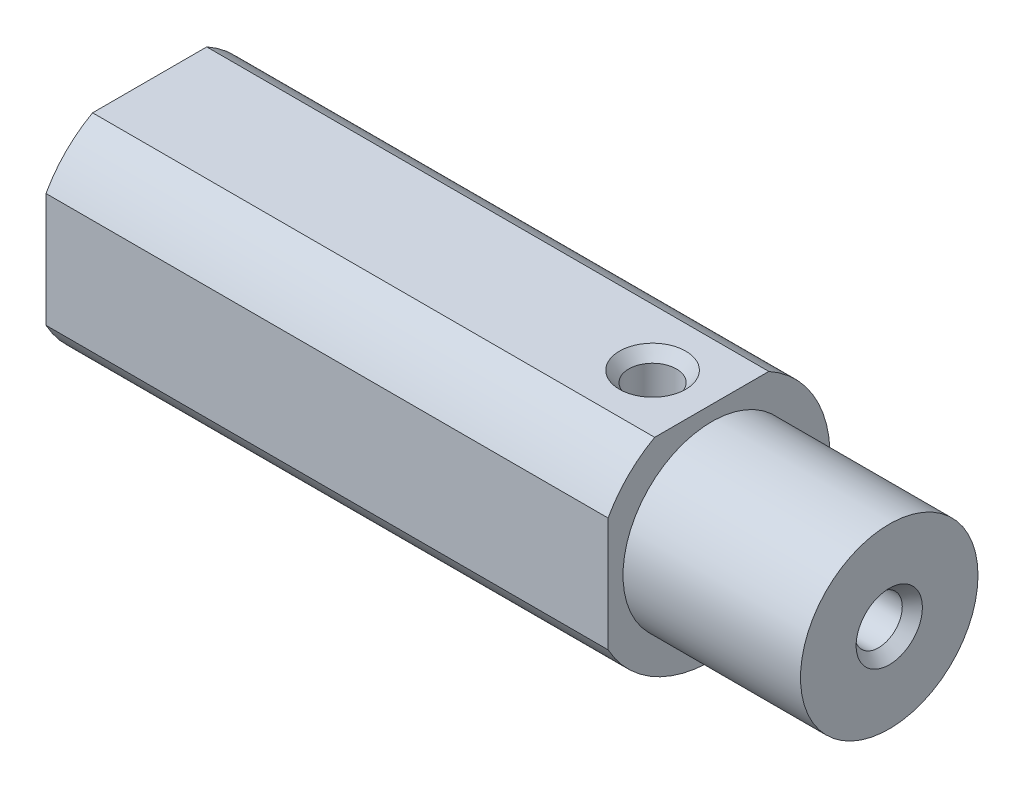
ISO-10303-21;
HEADER;
FILE_DESCRIPTION(('STEP AP214'),'2;1');
FILE_NAME('part.step','',(''),(''),'','','');
FILE_SCHEMA(('AUTOMOTIVE_DESIGN { 1 0 10303 214 1 1 1 1 }'));
ENDSEC;
DATA;
#1=APPLICATION_CONTEXT('core data for automotive mechanical design processes');
#2=APPLICATION_PROTOCOL_DEFINITION('international standard','automotive_design',2000,#1);
#3=PRODUCT_CONTEXT('',#1,'mechanical');
#4=PRODUCT('Part','Part','',(#3));
#5=PRODUCT_RELATED_PRODUCT_CATEGORY('part','',(#4));
#6=PRODUCT_DEFINITION_FORMATION('','',#4);
#7=PRODUCT_DEFINITION_CONTEXT('part definition',#1,'design');
#8=PRODUCT_DEFINITION('design','',#6,#7);
#9=PRODUCT_DEFINITION_SHAPE('','',#8);
#10=(LENGTH_UNIT() NAMED_UNIT(*) SI_UNIT(.MILLI.,.METRE.));
#11=(NAMED_UNIT(*) PLANE_ANGLE_UNIT() SI_UNIT($,.RADIAN.));
#12=(NAMED_UNIT(*) SI_UNIT($,.STERADIAN.) SOLID_ANGLE_UNIT());
#13=UNCERTAINTY_MEASURE_WITH_UNIT(LENGTH_MEASURE(1.E-05),#10,'distance_accuracy_value','');
#14=(GEOMETRIC_REPRESENTATION_CONTEXT(3) GLOBAL_UNCERTAINTY_ASSIGNED_CONTEXT((#13)) GLOBAL_UNIT_ASSIGNED_CONTEXT((#10,
#11,#12)) REPRESENTATION_CONTEXT('',''));
#15=CARTESIAN_POINT('',(0.,0.,0.));
#16=DIRECTION('',(0.,0.,1.));
#17=DIRECTION('',(1.,0.,0.));
#18=AXIS2_PLACEMENT_3D('',#15,#16,#17);
#19=CARTESIAN_POINT('',(-79.375,0.,0.));
#20=DIRECTION('',(1.,0.,0.));
#21=DIRECTION('',(0.,0.,-1.));
#22=AXIS2_PLACEMENT_3D('',#19,#20,#21);
#23=CYLINDRICAL_SURFACE('',#22,12.7);
#24=CARTESIAN_POINT('',(-19.05,0.,0.));
#25=DIRECTION('',(1.,0.,0.));
#26=DIRECTION('',(0.,0.,-1.));
#27=AXIS2_PLACEMENT_3D('',#24,#25,#26);
#28=CIRCLE('',#27,12.7);
#29=CARTESIAN_POINT('',(-19.05,6.12535100708523,11.1252));
#30=VERTEX_POINT('',#29);
#31=CARTESIAN_POINT('',(-19.05,11.1252,6.12535100708523));
#32=VERTEX_POINT('',#31);
#33=EDGE_CURVE('E141',#30,#32,#28,.F.);
#34=ORIENTED_EDGE('',*,*,#33,.T.);
#35=DIRECTION('',(1.,0.,0.));
#36=VECTOR('',#35,1.);
#37=CARTESIAN_POINT('',(-79.375,11.1252,6.12535100708523));
#38=LINE('',#37,#36);
#39=CARTESIAN_POINT('',(-79.375,11.1252,6.12535100708523));
#40=VERTEX_POINT('',#39);
#41=EDGE_CURVE('E62',#32,#40,#38,.F.);
#42=ORIENTED_EDGE('',*,*,#41,.T.);
#43=CARTESIAN_POINT('',(-79.375,0.,0.));
#44=DIRECTION('',(1.,0.,0.));
#45=DIRECTION('',(0.,0.,-1.));
#46=AXIS2_PLACEMENT_3D('',#43,#44,#45);
#47=CIRCLE('',#46,12.7);
#48=CARTESIAN_POINT('',(-79.375,6.12535100708523,11.1252));
#49=VERTEX_POINT('',#48);
#50=EDGE_CURVE('E140',#40,#49,#47,.T.);
#51=ORIENTED_EDGE('',*,*,#50,.T.);
#52=DIRECTION('',(1.,0.,0.));
#53=VECTOR('',#52,1.);
#54=CARTESIAN_POINT('',(-79.375,6.12535100708523,11.1252));
#55=LINE('',#54,#53);
#56=EDGE_CURVE('E124',#49,#30,#55,.T.);
#57=ORIENTED_EDGE('',*,*,#56,.T.);
#58=EDGE_LOOP('',(#34,#42,#51,#57));
#59=FACE_BOUND('',#58,.T.);
#60=ADVANCED_FACE('F48',(#59),#23,.T.);
#61=CARTESIAN_POINT('',(-79.375,-6.12535100708523,11.1252));
#62=VERTEX_POINT('',#61);
#63=CARTESIAN_POINT('',(-79.375,11.1252,-6.12535100708523));
#64=VERTEX_POINT('',#63);
#65=EDGE_CURVE('E137',#62,#64,#47,.T.);
#66=ORIENTED_EDGE('',*,*,#65,.T.);
#67=DIRECTION('',(1.,0.,0.));
#68=VECTOR('',#67,1.);
#69=CARTESIAN_POINT('',(-79.375,11.1252,-6.12535100708523));
#70=LINE('',#69,#68);
#71=CARTESIAN_POINT('',(-19.05,11.1252,-6.12535100708523));
#72=VERTEX_POINT('',#71);
#73=EDGE_CURVE('E119',#64,#72,#70,.T.);
#74=ORIENTED_EDGE('',*,*,#73,.T.);
#75=CARTESIAN_POINT('',(-19.05,-6.12535100708523,11.1252));
#76=VERTEX_POINT('',#75);
#77=EDGE_CURVE('E69',#72,#76,#28,.F.);
#78=ORIENTED_EDGE('',*,*,#77,.T.);
#79=DIRECTION('',(1.,0.,0.));
#80=VECTOR('',#79,1.);
#81=CARTESIAN_POINT('',(-79.375,-6.12535100708523,11.1252));
#82=LINE('',#81,#80);
#83=EDGE_CURVE('E127',#76,#62,#82,.F.);
#84=ORIENTED_EDGE('',*,*,#83,.T.);
#85=EDGE_LOOP('',(#66,#74,#78,#84));
#86=FACE_BOUND('',#85,.T.);
#87=ADVANCED_FACE('F157',(#86),#23,.T.);
#88=CARTESIAN_POINT('',(-79.375,0.,0.));
#89=DIRECTION('',(1.,0.,0.));
#90=DIRECTION('',(0.,0.,-1.));
#91=AXIS2_PLACEMENT_3D('',#88,#89,#90);
#92=PLANE('',#91);
#93=DIRECTION('',(0.,0.,1.));
#94=VECTOR('',#93,1.);
#95=CARTESIAN_POINT('',(-79.375,11.1252,0.));
#96=LINE('',#95,#94);
#97=EDGE_CURVE('E122',#64,#40,#96,.T.);
#98=ORIENTED_EDGE('',*,*,#97,.F.);
#99=ORIENTED_EDGE('',*,*,#65,.F.);
#100=DIRECTION('',(0.,-1.,0.));
#101=VECTOR('',#100,1.);
#102=CARTESIAN_POINT('',(-79.375,0.,11.1252));
#103=LINE('',#102,#101);
#104=EDGE_CURVE('E129',#49,#62,#103,.T.);
#105=ORIENTED_EDGE('',*,*,#104,.F.);
#106=ORIENTED_EDGE('',*,*,#50,.F.);
#107=EDGE_LOOP('',(#98,#99,#105,#106));
#108=FACE_BOUND('',#107,.T.);
#109=ADVANCED_FACE('F155',(#108),#92,.F.);
#110=CARTESIAN_POINT('',(-19.05,0.,0.));
#111=DIRECTION('',(1.,0.,0.));
#112=DIRECTION('',(0.,0.,-1.));
#113=AXIS2_PLACEMENT_3D('',#110,#111,#112);
#114=PLANE('',#113);
#115=CARTESIAN_POINT('',(-19.05,0.,0.));
#116=DIRECTION('',(1.,0.,0.));
#117=DIRECTION('',(0.,0.,-1.));
#118=AXIS2_PLACEMENT_3D('',#115,#116,#117);
#119=CIRCLE('',#118,9.525);
#120=CARTESIAN_POINT('',(-19.05,0.,-9.525));
#121=VERTEX_POINT('',#120);
#122=EDGE_CURVE('E132',#121,#121,#119,.T.);
#123=ORIENTED_EDGE('',*,*,#122,.F.);
#124=EDGE_LOOP('',(#123));
#125=FACE_BOUND('',#124,.T.);
#126=ORIENTED_EDGE('',*,*,#77,.F.);
#127=DIRECTION('',(0.,0.,1.));
#128=VECTOR('',#127,1.);
#129=CARTESIAN_POINT('',(-19.05,11.1252,0.));
#130=LINE('',#129,#128);
#131=EDGE_CURVE('E13',#72,#32,#130,.T.);
#132=ORIENTED_EDGE('',*,*,#131,.T.);
#133=ORIENTED_EDGE('',*,*,#33,.F.);
#134=DIRECTION('',(0.,-1.,0.));
#135=VECTOR('',#134,1.);
#136=CARTESIAN_POINT('',(-19.05,0.,11.1252));
#137=LINE('',#136,#135);
#138=EDGE_CURVE('E55',#30,#76,#137,.T.);
#139=ORIENTED_EDGE('',*,*,#138,.T.);
#140=EDGE_LOOP('',(#126,#132,#133,#139));
#141=FACE_BOUND('',#140,.T.);
#142=ADVANCED_FACE('F146',(#125,#141),#114,.T.);
#143=CARTESIAN_POINT('',(-19.05,0.,0.));
#144=DIRECTION('',(1.,0.,0.));
#145=DIRECTION('',(0.,0.,-1.));
#146=AXIS2_PLACEMENT_3D('',#143,#144,#145);
#147=CYLINDRICAL_SURFACE('',#146,9.525);
#148=ORIENTED_EDGE('',*,*,#122,.T.);
#149=EDGE_LOOP('',(#148));
#150=FACE_BOUND('',#149,.T.);
#151=CARTESIAN_POINT('',(0.,0.,0.));
#152=DIRECTION('',(1.,0.,0.));
#153=DIRECTION('',(0.,0.,-1.));
#154=AXIS2_PLACEMENT_3D('',#151,#152,#153);
#155=CIRCLE('',#154,9.525);
#156=CARTESIAN_POINT('',(0.,0.,-9.525));
#157=VERTEX_POINT('',#156);
#158=EDGE_CURVE('E131',#157,#157,#155,.T.);
#159=ORIENTED_EDGE('',*,*,#158,.F.);
#160=EDGE_LOOP('',(#159));
#161=FACE_BOUND('',#160,.T.);
#162=ADVANCED_FACE('F184',(#150,#161),#147,.T.);
#163=CARTESIAN_POINT('',(0.,0.,0.));
#164=DIRECTION('',(1.,0.,0.));
#165=DIRECTION('',(0.,0.,-1.));
#166=AXIS2_PLACEMENT_3D('',#163,#164,#165);
#167=PLANE('',#166);
#168=CARTESIAN_POINT('',(0.,0.,0.));
#169=DIRECTION('',(1.,0.,0.));
#170=DIRECTION('',(0.,0.,-1.));
#171=AXIS2_PLACEMENT_3D('',#168,#169,#170);
#172=CIRCLE('',#171,3.556);
#173=CARTESIAN_POINT('',(0.,0.,-3.556));
#174=VERTEX_POINT('',#173);
#175=EDGE_CURVE('E110',#174,#174,#172,.T.);
#176=ORIENTED_EDGE('',*,*,#175,.F.);
#177=EDGE_LOOP('',(#176));
#178=FACE_BOUND('',#177,.T.);
#179=ORIENTED_EDGE('',*,*,#158,.T.);
#180=EDGE_LOOP('',(#179));
#181=FACE_BOUND('',#180,.T.);
#182=ADVANCED_FACE('F170',(#178,#181),#167,.T.);
#183=CARTESIAN_POINT('',(-91.2436173816218,-25.5220707846333,11.1252));
#184=DIRECTION('',(0.,0.,1.));
#185=DIRECTION('',(1.,0.,0.));
#186=AXIS2_PLACEMENT_3D('',#183,#184,#185);
#187=PLANE('',#186);
#188=ORIENTED_EDGE('',*,*,#104,.T.);
#189=ORIENTED_EDGE('',*,*,#83,.F.);
#190=ORIENTED_EDGE('',*,*,#138,.F.);
#191=ORIENTED_EDGE('',*,*,#56,.F.);
#192=EDGE_LOOP('',(#188,#189,#190,#191));
#193=FACE_BOUND('',#192,.T.);
#194=ADVANCED_FACE('F149',(#193),#187,.T.);
#195=CARTESIAN_POINT('',(-96.4133134907001,11.1252,24.8096946684768));
#196=DIRECTION('',(0.,1.,0.));
#197=DIRECTION('',(0.,0.,1.));
#198=AXIS2_PLACEMENT_3D('',#195,#196,#197);
#199=PLANE('',#198);
#200=CARTESIAN_POINT('',(-25.4,11.1252,0.));
#201=DIRECTION('',(0.,1.,0.));
#202=DIRECTION('',(0.,0.,1.));
#203=AXIS2_PLACEMENT_3D('',#200,#201,#202);
#204=CIRCLE('',#203,3.556);
#205=CARTESIAN_POINT('',(-25.4,11.1252,3.556));
#206=VERTEX_POINT('',#205);
#207=EDGE_CURVE('E103',#206,#206,#204,.T.);
#208=ORIENTED_EDGE('',*,*,#207,.F.);
#209=EDGE_LOOP('',(#208));
#210=FACE_BOUND('',#209,.T.);
#211=ORIENTED_EDGE('',*,*,#97,.T.);
#212=ORIENTED_EDGE('',*,*,#41,.F.);
#213=ORIENTED_EDGE('',*,*,#131,.F.);
#214=ORIENTED_EDGE('',*,*,#73,.F.);
#215=EDGE_LOOP('',(#211,#212,#213,#214));
#216=FACE_BOUND('',#215,.T.);
#217=ADVANCED_FACE('F158',(#210,#216),#199,.T.);
#218=CARTESIAN_POINT('',(-25.4,-4.8768,0.));
#219=DIRECTION('',(0.,1.,0.));
#220=DIRECTION('',(0.,0.,1.));
#221=AXIS2_PLACEMENT_3D('',#218,#219,#220);
#222=CONICAL_SURFACE('',#221,2.5527,1.02974425867665);
#223=CARTESIAN_POINT('',(-25.4,-6.41061690219165,0.));
#224=VERTEX_POINT('',#223);
#225=VERTEX_LOOP('',#224);
#226=FACE_BOUND('',#225,.T.);
#227=CARTESIAN_POINT('',(-25.4,-4.8768,0.));
#228=DIRECTION('',(0.,1.,0.));
#229=DIRECTION('',(0.,0.,1.));
#230=AXIS2_PLACEMENT_3D('',#227,#228,#229);
#231=CIRCLE('',#230,2.5527);
#232=CARTESIAN_POINT('',(-25.4,-4.8768,2.5527));
#233=VERTEX_POINT('',#232);
#234=EDGE_CURVE('E116',#233,#233,#231,.T.);
#235=ORIENTED_EDGE('',*,*,#234,.T.);
#236=EDGE_LOOP('',(#235));
#237=FACE_BOUND('',#236,.T.);
#238=ADVANCED_FACE('F160',(#226,#237),#222,.F.);
#239=CARTESIAN_POINT('',(-25.4,11.1252,0.));
#240=DIRECTION('',(0.,1.,0.));
#241=DIRECTION('',(0.,0.,1.));
#242=AXIS2_PLACEMENT_3D('',#239,#240,#241);
#243=CYLINDRICAL_SURFACE('',#242,2.55269999999999);
#244=ORIENTED_EDGE('',*,*,#234,.F.);
#245=EDGE_LOOP('',(#244));
#246=FACE_BOUND('',#245,.T.);
#247=CARTESIAN_POINT('',(-25.4,9.97103537703515,0.));
#248=DIRECTION('',(0.,1.,0.));
#249=DIRECTION('',(0.,0.,1.));
#250=AXIS2_PLACEMENT_3D('',#247,#248,#249);
#251=CIRCLE('',#250,2.55269999999999);
#252=CARTESIAN_POINT('',(-25.4,9.97103537703515,2.55269999999999));
#253=VERTEX_POINT('',#252);
#254=EDGE_CURVE('E107',#253,#253,#251,.T.);
#255=ORIENTED_EDGE('',*,*,#254,.T.);
#256=EDGE_LOOP('',(#255));
#257=FACE_BOUND('',#256,.T.);
#258=ADVANCED_FACE('F167',(#246,#257),#243,.F.);
#259=CARTESIAN_POINT('',(-25.4,11.1252,0.));
#260=DIRECTION('',(0.,1.,0.));
#261=DIRECTION('',(0.,0.,1.));
#262=AXIS2_PLACEMENT_3D('',#259,#260,#261);
#263=CONICAL_SURFACE('',#262,3.556,0.715584993317676);
#264=ORIENTED_EDGE('',*,*,#254,.F.);
#265=EDGE_LOOP('',(#264));
#266=FACE_BOUND('',#265,.T.);
#267=ORIENTED_EDGE('',*,*,#207,.T.);
#268=EDGE_LOOP('',(#267));
#269=FACE_BOUND('',#268,.T.);
#270=ADVANCED_FACE('F97',(#266,#269),#263,.F.);
#271=CARTESIAN_POINT('',(-16.002,0.,0.));
#272=DIRECTION('',(1.,0.,0.));
#273=DIRECTION('',(0.,0.,-1.));
#274=AXIS2_PLACEMENT_3D('',#271,#272,#273);
#275=CONICAL_SURFACE('',#274,2.5527,1.02974425867665);
#276=CARTESIAN_POINT('',(-17.5358169021917,0.,0.));
#277=VERTEX_POINT('',#276);
#278=VERTEX_LOOP('',#277);
#279=FACE_BOUND('',#278,.T.);
#280=CARTESIAN_POINT('',(-16.002,0.,0.));
#281=DIRECTION('',(1.,0.,0.));
#282=DIRECTION('',(0.,0.,-1.));
#283=AXIS2_PLACEMENT_3D('',#280,#281,#282);
#284=CIRCLE('',#283,2.5527);
#285=CARTESIAN_POINT('',(-16.002,0.,-2.5527));
#286=VERTEX_POINT('',#285);
#287=EDGE_CURVE('E101',#286,#286,#284,.T.);
#288=ORIENTED_EDGE('',*,*,#287,.T.);
#289=EDGE_LOOP('',(#288));
#290=FACE_BOUND('',#289,.T.);
#291=ADVANCED_FACE('F93',(#279,#290),#275,.F.);
#292=CARTESIAN_POINT('',(0.,0.,0.));
#293=DIRECTION('',(1.,0.,0.));
#294=DIRECTION('',(0.,0.,-1.));
#295=AXIS2_PLACEMENT_3D('',#292,#293,#294);
#296=CYLINDRICAL_SURFACE('',#295,2.55269999999999);
#297=ORIENTED_EDGE('',*,*,#287,.F.);
#298=EDGE_LOOP('',(#297));
#299=FACE_BOUND('',#298,.T.);
#300=CARTESIAN_POINT('',(-1.15416462296485,0.,0.));
#301=DIRECTION('',(1.,0.,0.));
#302=DIRECTION('',(0.,0.,-1.));
#303=AXIS2_PLACEMENT_3D('',#300,#301,#302);
#304=CIRCLE('',#303,2.55269999999999);
#305=CARTESIAN_POINT('',(-1.15416462296485,0.,-2.55269999999999));
#306=VERTEX_POINT('',#305);
#307=EDGE_CURVE('E104',#306,#306,#304,.T.);
#308=ORIENTED_EDGE('',*,*,#307,.T.);
#309=EDGE_LOOP('',(#308));
#310=FACE_BOUND('',#309,.T.);
#311=ADVANCED_FACE('F96',(#299,#310),#296,.F.);
#312=CARTESIAN_POINT('',(0.,0.,0.));
#313=DIRECTION('',(1.,0.,0.));
#314=DIRECTION('',(0.,0.,-1.));
#315=AXIS2_PLACEMENT_3D('',#312,#313,#314);
#316=CONICAL_SURFACE('',#315,3.556,0.715584993317677);
#317=ORIENTED_EDGE('',*,*,#307,.F.);
#318=EDGE_LOOP('',(#317));
#319=FACE_BOUND('',#318,.T.);
#320=ORIENTED_EDGE('',*,*,#175,.T.);
#321=EDGE_LOOP('',(#320));
#322=FACE_BOUND('',#321,.T.);
#323=ADVANCED_FACE('F200',(#319,#322),#316,.F.);
#324=CLOSED_SHELL('',(#60,#87,#109,#142,#162,#182,#194,#217,#238,#258,#270,#291,#311,#323));
#325=MANIFOLD_SOLID_BREP('B2',#324);
#326=ADVANCED_BREP_SHAPE_REPRESENTATION('',(#18,#325),#14);
#327=SHAPE_DEFINITION_REPRESENTATION(#9,#326);
ENDSEC;
END-ISO-10303-21;
